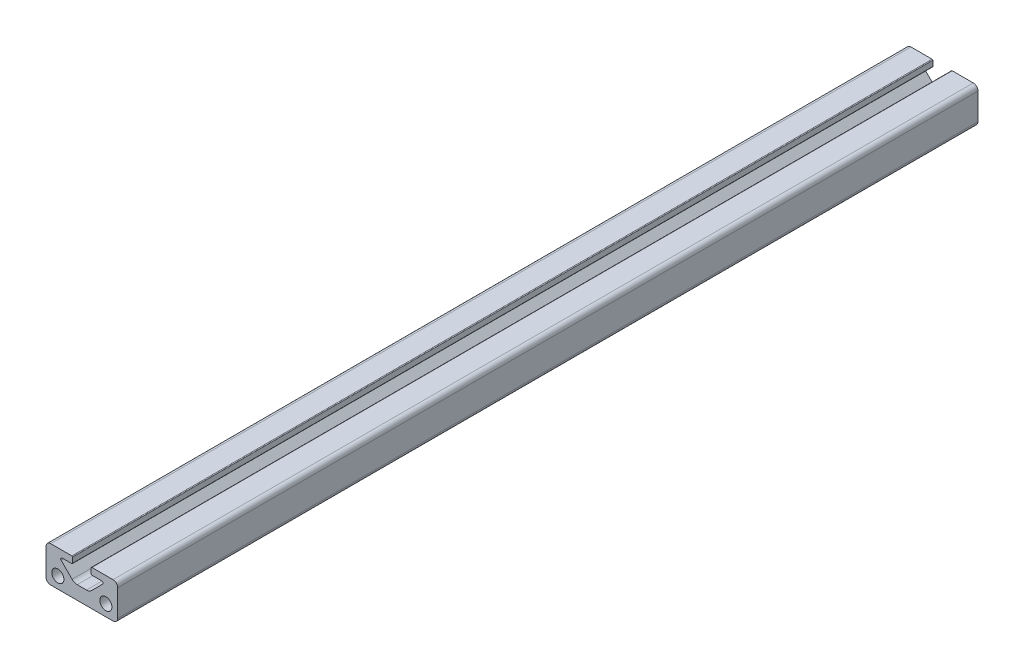
ISO-10303-21;
HEADER;
FILE_DESCRIPTION(('STEP AP214'),'2;1');
FILE_NAME('part.step','',(''),(''),'','','');
FILE_SCHEMA(('AUTOMOTIVE_DESIGN { 1 0 10303 214 1 1 1 1 }'));
ENDSEC;
DATA;
#1=APPLICATION_CONTEXT('core data for automotive mechanical design processes');
#2=APPLICATION_PROTOCOL_DEFINITION('international standard','automotive_design',2000,#1);
#3=PRODUCT_CONTEXT('',#1,'mechanical');
#4=PRODUCT('Part','Part','',(#3));
#5=PRODUCT_RELATED_PRODUCT_CATEGORY('part','',(#4));
#6=PRODUCT_DEFINITION_FORMATION('','',#4);
#7=PRODUCT_DEFINITION_CONTEXT('part definition',#1,'design');
#8=PRODUCT_DEFINITION('design','',#6,#7);
#9=PRODUCT_DEFINITION_SHAPE('','',#8);
#10=(LENGTH_UNIT() NAMED_UNIT(*) SI_UNIT(.MILLI.,.METRE.));
#11=(NAMED_UNIT(*) PLANE_ANGLE_UNIT() SI_UNIT($,.RADIAN.));
#12=(NAMED_UNIT(*) SI_UNIT($,.STERADIAN.) SOLID_ANGLE_UNIT());
#13=UNCERTAINTY_MEASURE_WITH_UNIT(LENGTH_MEASURE(1.E-05),#10,'distance_accuracy_value','');
#14=(GEOMETRIC_REPRESENTATION_CONTEXT(3) GLOBAL_UNCERTAINTY_ASSIGNED_CONTEXT((#13)) GLOBAL_UNIT_ASSIGNED_CONTEXT((#10,
#11,#12)) REPRESENTATION_CONTEXT('',''));
#15=CARTESIAN_POINT('',(0.,0.,0.));
#16=DIRECTION('',(0.,0.,1.));
#17=DIRECTION('',(1.,0.,0.));
#18=AXIS2_PLACEMENT_3D('',#15,#16,#17);
#19=CARTESIAN_POINT('',(-11.049,11.049,152.4));
#20=DIRECTION('',(0.,0.,1.));
#21=DIRECTION('',(1.,0.,0.));
#22=AXIS2_PLACEMENT_3D('',#19,#20,#21);
#23=PLANE('',#22);
#24=CARTESIAN_POINT('',(8.509,4.064,152.4));
#25=DIRECTION('',(0.,0.,1.));
#26=DIRECTION('',(1.,0.,0.));
#27=AXIS2_PLACEMENT_3D('',#24,#25,#26);
#28=CIRCLE('',#27,2.1463);
#29=CARTESIAN_POINT('',(10.6553,4.064,152.4));
#30=VERTEX_POINT('',#29);
#31=EDGE_CURVE('E513',#30,#30,#28,.T.);
#32=ORIENTED_EDGE('',*,*,#31,.F.);
#33=EDGE_LOOP('',(#32));
#34=FACE_BOUND('',#33,.T.);
#35=DIRECTION('',(0.,-1.,0.));
#36=VECTOR('',#35,1.);
#37=CARTESIAN_POINT('',(3.302,12.7,152.4));
#38=LINE('',#37,#36);
#39=CARTESIAN_POINT('',(3.302,12.446,152.4));
#40=VERTEX_POINT('',#39);
#41=CARTESIAN_POINT('',(3.302,10.582863886556,152.4));
#42=VERTEX_POINT('',#41);
#43=EDGE_CURVE('E480',#40,#42,#38,.T.);
#44=ORIENTED_EDGE('',*,*,#43,.T.);
#45=CARTESIAN_POINT('',(3.556,10.582863886556,152.4));
#46=DIRECTION('',(0.,0.,1.));
#47=DIRECTION('',(1.,0.,0.));
#48=AXIS2_PLACEMENT_3D('',#45,#46,#47);
#49=CIRCLE('',#48,0.254);
#50=CARTESIAN_POINT('',(3.556,10.328863886556,152.4));
#51=VERTEX_POINT('',#50);
#52=EDGE_CURVE('E269',#42,#51,#49,.T.);
#53=ORIENTED_EDGE('',*,*,#52,.T.);
#54=DIRECTION('',(1.,0.,0.));
#55=VECTOR('',#54,1.);
#56=CARTESIAN_POINT('',(3.302,10.328863886556,152.4));
#57=LINE('',#56,#55);
#58=CARTESIAN_POINT('',(6.985,10.328863886556,152.4));
#59=VERTEX_POINT('',#58);
#60=EDGE_CURVE('E472',#51,#59,#57,.T.);
#61=ORIENTED_EDGE('',*,*,#60,.T.);
#62=CARTESIAN_POINT('',(6.985,9.82086388655604,152.4));
#63=DIRECTION('',(0.,0.,-1.));
#64=DIRECTION('',(1.,0.,0.));
#65=AXIS2_PLACEMENT_3D('',#62,#63,#64);
#66=CIRCLE('',#65,0.508);
#67=CARTESIAN_POINT('',(7.34421024484277,9.46165364171327,152.4));
#68=VERTEX_POINT('',#67);
#69=EDGE_CURVE('E465',#59,#68,#66,.T.);
#70=ORIENTED_EDGE('',*,*,#69,.T.);
#71=DIRECTION('',(-0.707106781186546,-0.707106781186549,0.));
#72=VECTOR('',#71,1.);
#73=CARTESIAN_POINT('',(7.34421024484277,9.46165364171327,152.4));
#74=LINE('',#73,#72);
#75=CARTESIAN_POINT('',(3.45250537891568,5.56994877578617,152.4));
#76=VERTEX_POINT('',#75);
#77=EDGE_CURVE('E460',#68,#76,#74,.T.);
#78=ORIENTED_EDGE('',*,*,#77,.T.);
#79=CARTESIAN_POINT('',(1.65645415470184,7.366,152.4));
#80=DIRECTION('',(0.,0.,-1.));
#81=DIRECTION('',(1.,0.,0.));
#82=AXIS2_PLACEMENT_3D('',#79,#80,#81);
#83=CIRCLE('',#82,2.54);
#84=CARTESIAN_POINT('',(1.65645415470184,4.826,152.4));
#85=VERTEX_POINT('',#84);
#86=EDGE_CURVE('E456',#76,#85,#83,.T.);
#87=ORIENTED_EDGE('',*,*,#86,.T.);
#88=DIRECTION('',(-1.,0.,0.));
#89=VECTOR('',#88,1.);
#90=CARTESIAN_POINT('',(1.65645415470184,4.826,152.4));
#91=LINE('',#90,#89);
#92=CARTESIAN_POINT('',(-1.65645415470184,4.826,152.4));
#93=VERTEX_POINT('',#92);
#94=EDGE_CURVE('E447',#85,#93,#91,.T.);
#95=ORIENTED_EDGE('',*,*,#94,.T.);
#96=CARTESIAN_POINT('',(-1.65645415470184,7.366,152.4));
#97=DIRECTION('',(0.,0.,-1.));
#98=DIRECTION('',(1.,0.,0.));
#99=AXIS2_PLACEMENT_3D('',#96,#97,#98);
#100=CIRCLE('',#99,2.54);
#101=CARTESIAN_POINT('',(-3.45250537891568,5.56994877578617,152.4));
#102=VERTEX_POINT('',#101);
#103=EDGE_CURVE('E442',#93,#102,#100,.T.);
#104=ORIENTED_EDGE('',*,*,#103,.T.);
#105=DIRECTION('',(-0.707106781186546,0.707106781186549,0.));
#106=VECTOR('',#105,1.);
#107=CARTESIAN_POINT('',(-3.45250537891568,5.56994877578617,152.4));
#108=LINE('',#107,#106);
#109=CARTESIAN_POINT('',(-7.34421024484277,9.46165364171327,152.4));
#110=VERTEX_POINT('',#109);
#111=EDGE_CURVE('E438',#102,#110,#108,.T.);
#112=ORIENTED_EDGE('',*,*,#111,.T.);
#113=CARTESIAN_POINT('',(-6.985,9.82086388655604,152.4));
#114=DIRECTION('',(0.,0.,-1.));
#115=DIRECTION('',(1.,0.,0.));
#116=AXIS2_PLACEMENT_3D('',#113,#114,#115);
#117=CIRCLE('',#116,0.507999999999999);
#118=CARTESIAN_POINT('',(-6.985,10.328863886556,152.4));
#119=VERTEX_POINT('',#118);
#120=EDGE_CURVE('E294',#110,#119,#117,.T.);
#121=ORIENTED_EDGE('',*,*,#120,.T.);
#122=DIRECTION('',(1.,0.,0.));
#123=VECTOR('',#122,1.);
#124=CARTESIAN_POINT('',(-6.985,10.328863886556,152.4));
#125=LINE('',#124,#123);
#126=CARTESIAN_POINT('',(-3.556,10.328863886556,152.4));
#127=VERTEX_POINT('',#126);
#128=EDGE_CURVE('E288',#119,#127,#125,.T.);
#129=ORIENTED_EDGE('',*,*,#128,.T.);
#130=CARTESIAN_POINT('',(-3.556,10.582863886556,152.4));
#131=DIRECTION('',(0.,0.,1.));
#132=DIRECTION('',(1.,0.,0.));
#133=AXIS2_PLACEMENT_3D('',#130,#131,#132);
#134=CIRCLE('',#133,0.254);
#135=CARTESIAN_POINT('',(-3.302,10.582863886556,152.4));
#136=VERTEX_POINT('',#135);
#137=EDGE_CURVE('E263',#127,#136,#134,.T.);
#138=ORIENTED_EDGE('',*,*,#137,.T.);
#139=DIRECTION('',(0.,1.,0.));
#140=VECTOR('',#139,1.);
#141=CARTESIAN_POINT('',(-3.302,12.7,152.4));
#142=LINE('',#141,#140);
#143=CARTESIAN_POINT('',(-3.302,12.446,152.4));
#144=VERTEX_POINT('',#143);
#145=EDGE_CURVE('E297',#136,#144,#142,.T.);
#146=ORIENTED_EDGE('',*,*,#145,.T.);
#147=CARTESIAN_POINT('',(-3.556,12.446,152.4));
#148=DIRECTION('',(0.,0.,1.));
#149=DIRECTION('',(1.,0.,0.));
#150=AXIS2_PLACEMENT_3D('',#147,#148,#149);
#151=CIRCLE('',#150,0.254);
#152=CARTESIAN_POINT('',(-3.556,12.7,152.4));
#153=VERTEX_POINT('',#152);
#154=EDGE_CURVE('E57',#144,#153,#151,.T.);
#155=ORIENTED_EDGE('',*,*,#154,.T.);
#156=DIRECTION('',(-1.,0.,0.));
#157=VECTOR('',#156,1.);
#158=CARTESIAN_POINT('',(-11.049,12.7,152.4));
#159=LINE('',#158,#157);
#160=CARTESIAN_POINT('',(-11.049,12.7,152.4));
#161=VERTEX_POINT('',#160);
#162=EDGE_CURVE('E221',#153,#161,#159,.T.);
#163=ORIENTED_EDGE('',*,*,#162,.T.);
#164=CARTESIAN_POINT('',(-11.049,11.049,152.4));
#165=DIRECTION('',(0.,0.,1.));
#166=DIRECTION('',(1.,0.,0.));
#167=AXIS2_PLACEMENT_3D('',#164,#165,#166);
#168=CIRCLE('',#167,1.651);
#169=CARTESIAN_POINT('',(-12.7,11.049,152.4));
#170=VERTEX_POINT('',#169);
#171=EDGE_CURVE('E216',#161,#170,#168,.T.);
#172=ORIENTED_EDGE('',*,*,#171,.T.);
#173=DIRECTION('',(0.,-1.,0.));
#174=VECTOR('',#173,1.);
#175=CARTESIAN_POINT('',(-12.7,11.049,152.4));
#176=LINE('',#175,#174);
#177=CARTESIAN_POINT('',(-12.7,1.65099999999999,152.4));
#178=VERTEX_POINT('',#177);
#179=EDGE_CURVE('E205',#170,#178,#176,.T.);
#180=ORIENTED_EDGE('',*,*,#179,.T.);
#181=CARTESIAN_POINT('',(-11.049,1.65099999999999,152.4));
#182=DIRECTION('',(0.,0.,1.));
#183=DIRECTION('',(1.,0.,0.));
#184=AXIS2_PLACEMENT_3D('',#181,#182,#183);
#185=CIRCLE('',#184,1.651);
#186=CARTESIAN_POINT('',(-11.049,0.,152.4));
#187=VERTEX_POINT('',#186);
#188=EDGE_CURVE('E215',#178,#187,#185,.T.);
#189=ORIENTED_EDGE('',*,*,#188,.T.);
#190=DIRECTION('',(1.,0.,0.));
#191=VECTOR('',#190,1.);
#192=CARTESIAN_POINT('',(11.049,0.,152.4));
#193=LINE('',#192,#191);
#194=CARTESIAN_POINT('',(11.049,0.,152.4));
#195=VERTEX_POINT('',#194);
#196=EDGE_CURVE('E376',#187,#195,#193,.T.);
#197=ORIENTED_EDGE('',*,*,#196,.T.);
#198=CARTESIAN_POINT('',(11.049,1.651,152.4));
#199=DIRECTION('',(0.,0.,1.));
#200=DIRECTION('',(1.,0.,0.));
#201=AXIS2_PLACEMENT_3D('',#198,#199,#200);
#202=CIRCLE('',#201,1.651);
#203=CARTESIAN_POINT('',(12.7,1.651,152.4));
#204=VERTEX_POINT('',#203);
#205=EDGE_CURVE('E519',#195,#204,#202,.T.);
#206=ORIENTED_EDGE('',*,*,#205,.T.);
#207=DIRECTION('',(0.,1.,0.));
#208=VECTOR('',#207,1.);
#209=CARTESIAN_POINT('',(12.7,1.651,152.4));
#210=LINE('',#209,#208);
#211=CARTESIAN_POINT('',(12.7,11.049,152.4));
#212=VERTEX_POINT('',#211);
#213=EDGE_CURVE('E524',#204,#212,#210,.T.);
#214=ORIENTED_EDGE('',*,*,#213,.T.);
#215=CARTESIAN_POINT('',(11.049,11.049,152.4));
#216=DIRECTION('',(0.,0.,1.));
#217=DIRECTION('',(1.,0.,0.));
#218=AXIS2_PLACEMENT_3D('',#215,#216,#217);
#219=CIRCLE('',#218,1.651);
#220=CARTESIAN_POINT('',(11.049,12.7,152.4));
#221=VERTEX_POINT('',#220);
#222=EDGE_CURVE('E490',#212,#221,#219,.T.);
#223=ORIENTED_EDGE('',*,*,#222,.T.);
#224=DIRECTION('',(-1.,0.,0.));
#225=VECTOR('',#224,1.);
#226=CARTESIAN_POINT('',(3.302,12.7,152.4));
#227=LINE('',#226,#225);
#228=CARTESIAN_POINT('',(3.556,12.7,152.4));
#229=VERTEX_POINT('',#228);
#230=EDGE_CURVE('E485',#221,#229,#227,.T.);
#231=ORIENTED_EDGE('',*,*,#230,.T.);
#232=CARTESIAN_POINT('',(3.556,12.446,152.4));
#233=DIRECTION('',(0.,0.,1.));
#234=DIRECTION('',(1.,0.,0.));
#235=AXIS2_PLACEMENT_3D('',#232,#233,#234);
#236=CIRCLE('',#235,0.254);
#237=EDGE_CURVE('E266',#229,#40,#236,.T.);
#238=ORIENTED_EDGE('',*,*,#237,.T.);
#239=EDGE_LOOP('',(#44,#53,#61,#70,#78,#87,#95,#104,#112,#121,#129,#138,#146,#155,#163,#172,
#180,#189,#197,#206,#214,#223,#231,#238));
#240=FACE_BOUND('',#239,.T.);
#241=CARTESIAN_POINT('',(-8.509,4.064,152.4));
#242=DIRECTION('',(0.,0.,1.));
#243=DIRECTION('',(1.,0.,0.));
#244=AXIS2_PLACEMENT_3D('',#241,#242,#243);
#245=CIRCLE('',#244,2.1463);
#246=CARTESIAN_POINT('',(-6.3627,4.064,152.4));
#247=VERTEX_POINT('',#246);
#248=EDGE_CURVE('E782',#247,#247,#245,.T.);
#249=ORIENTED_EDGE('',*,*,#248,.F.);
#250=EDGE_LOOP('',(#249));
#251=FACE_BOUND('',#250,.T.);
#252=ADVANCED_FACE('F41',(#34,#240,#251),#23,.T.);
#253=CARTESIAN_POINT('',(-11.049,11.049,-152.4));
#254=DIRECTION('',(0.,0.,1.));
#255=DIRECTION('',(1.,0.,0.));
#256=AXIS2_PLACEMENT_3D('',#253,#254,#255);
#257=PLANE('',#256);
#258=DIRECTION('',(1.,0.,0.));
#259=VECTOR('',#258,1.);
#260=CARTESIAN_POINT('',(3.302,10.328863886556,-152.4));
#261=LINE('',#260,#259);
#262=CARTESIAN_POINT('',(3.556,10.328863886556,-152.4));
#263=VERTEX_POINT('',#262);
#264=CARTESIAN_POINT('',(6.985,10.328863886556,-152.4));
#265=VERTEX_POINT('',#264);
#266=EDGE_CURVE('E406',#263,#265,#261,.T.);
#267=ORIENTED_EDGE('',*,*,#266,.F.);
#268=CARTESIAN_POINT('',(3.556,10.582863886556,-152.4));
#269=DIRECTION('',(0.,0.,1.));
#270=DIRECTION('',(1.,0.,0.));
#271=AXIS2_PLACEMENT_3D('',#268,#269,#270);
#272=CIRCLE('',#271,0.254);
#273=CARTESIAN_POINT('',(3.302,10.582863886556,-152.4));
#274=VERTEX_POINT('',#273);
#275=EDGE_CURVE('E251',#263,#274,#272,.F.);
#276=ORIENTED_EDGE('',*,*,#275,.T.);
#277=DIRECTION('',(0.,-1.,0.));
#278=VECTOR('',#277,1.);
#279=CARTESIAN_POINT('',(3.302,12.7,-152.4));
#280=LINE('',#279,#278);
#281=CARTESIAN_POINT('',(3.302,12.446,-152.4));
#282=VERTEX_POINT('',#281);
#283=EDGE_CURVE('E402',#282,#274,#280,.T.);
#284=ORIENTED_EDGE('',*,*,#283,.F.);
#285=CARTESIAN_POINT('',(3.556,12.446,-152.4));
#286=DIRECTION('',(0.,0.,1.));
#287=DIRECTION('',(1.,0.,0.));
#288=AXIS2_PLACEMENT_3D('',#285,#286,#287);
#289=CIRCLE('',#288,0.254);
#290=CARTESIAN_POINT('',(3.556,12.7,-152.4));
#291=VERTEX_POINT('',#290);
#292=EDGE_CURVE('E248',#282,#291,#289,.F.);
#293=ORIENTED_EDGE('',*,*,#292,.T.);
#294=DIRECTION('',(-1.,0.,0.));
#295=VECTOR('',#294,1.);
#296=CARTESIAN_POINT('',(3.302,12.7,-152.4));
#297=LINE('',#296,#295);
#298=CARTESIAN_POINT('',(11.049,12.7,-152.4));
#299=VERTEX_POINT('',#298);
#300=EDGE_CURVE('E398',#299,#291,#297,.T.);
#301=ORIENTED_EDGE('',*,*,#300,.F.);
#302=CARTESIAN_POINT('',(11.049,11.049,-152.4));
#303=DIRECTION('',(0.,0.,1.));
#304=DIRECTION('',(1.,0.,0.));
#305=AXIS2_PLACEMENT_3D('',#302,#303,#304);
#306=CIRCLE('',#305,1.651);
#307=CARTESIAN_POINT('',(12.7,11.049,-152.4));
#308=VERTEX_POINT('',#307);
#309=EDGE_CURVE('E395',#308,#299,#306,.T.);
#310=ORIENTED_EDGE('',*,*,#309,.F.);
#311=DIRECTION('',(0.,1.,0.));
#312=VECTOR('',#311,1.);
#313=CARTESIAN_POINT('',(12.7,1.651,-152.4));
#314=LINE('',#313,#312);
#315=CARTESIAN_POINT('',(12.7,1.651,-152.4));
#316=VERTEX_POINT('',#315);
#317=EDGE_CURVE('E387',#316,#308,#314,.T.);
#318=ORIENTED_EDGE('',*,*,#317,.F.);
#319=CARTESIAN_POINT('',(11.049,1.651,-152.4));
#320=DIRECTION('',(0.,0.,1.));
#321=DIRECTION('',(1.,0.,0.));
#322=AXIS2_PLACEMENT_3D('',#319,#320,#321);
#323=CIRCLE('',#322,1.651);
#324=CARTESIAN_POINT('',(11.049,0.,-152.4));
#325=VERTEX_POINT('',#324);
#326=EDGE_CURVE('E382',#325,#316,#323,.T.);
#327=ORIENTED_EDGE('',*,*,#326,.F.);
#328=DIRECTION('',(1.,0.,0.));
#329=VECTOR('',#328,1.);
#330=CARTESIAN_POINT('',(11.049,0.,-152.4));
#331=LINE('',#330,#329);
#332=CARTESIAN_POINT('',(-11.049,0.,-152.4));
#333=VERTEX_POINT('',#332);
#334=EDGE_CURVE('E375',#333,#325,#331,.T.);
#335=ORIENTED_EDGE('',*,*,#334,.F.);
#336=CARTESIAN_POINT('',(-11.049,1.65099999999999,-152.4));
#337=DIRECTION('',(0.,0.,1.));
#338=DIRECTION('',(1.,0.,0.));
#339=AXIS2_PLACEMENT_3D('',#336,#337,#338);
#340=CIRCLE('',#339,1.651);
#341=CARTESIAN_POINT('',(-12.7,1.65099999999999,-152.4));
#342=VERTEX_POINT('',#341);
#343=EDGE_CURVE('E380',#342,#333,#340,.T.);
#344=ORIENTED_EDGE('',*,*,#343,.F.);
#345=DIRECTION('',(0.,-1.,0.));
#346=VECTOR('',#345,1.);
#347=CARTESIAN_POINT('',(-12.7,11.049,-152.4));
#348=LINE('',#347,#346);
#349=CARTESIAN_POINT('',(-12.7,11.049,-152.4));
#350=VERTEX_POINT('',#349);
#351=EDGE_CURVE('E389',#350,#342,#348,.T.);
#352=ORIENTED_EDGE('',*,*,#351,.F.);
#353=CARTESIAN_POINT('',(-11.049,11.049,-152.4));
#354=DIRECTION('',(0.,0.,1.));
#355=DIRECTION('',(1.,0.,0.));
#356=AXIS2_PLACEMENT_3D('',#353,#354,#355);
#357=CIRCLE('',#356,1.651);
#358=CARTESIAN_POINT('',(-11.049,12.7,-152.4));
#359=VERTEX_POINT('',#358);
#360=EDGE_CURVE('E230',#359,#350,#357,.T.);
#361=ORIENTED_EDGE('',*,*,#360,.F.);
#362=DIRECTION('',(-1.,0.,0.));
#363=VECTOR('',#362,1.);
#364=CARTESIAN_POINT('',(-11.049,12.7,-152.4));
#365=LINE('',#364,#363);
#366=CARTESIAN_POINT('',(-3.556,12.7,-152.4));
#367=VERTEX_POINT('',#366);
#368=EDGE_CURVE('E226',#367,#359,#365,.T.);
#369=ORIENTED_EDGE('',*,*,#368,.F.);
#370=CARTESIAN_POINT('',(-3.556,12.446,-152.4));
#371=DIRECTION('',(0.,0.,1.));
#372=DIRECTION('',(1.,0.,0.));
#373=AXIS2_PLACEMENT_3D('',#370,#371,#372);
#374=CIRCLE('',#373,0.254);
#375=CARTESIAN_POINT('',(-3.302,12.446,-152.4));
#376=VERTEX_POINT('',#375);
#377=EDGE_CURVE('E237',#367,#376,#374,.F.);
#378=ORIENTED_EDGE('',*,*,#377,.T.);
#379=DIRECTION('',(0.,1.,0.));
#380=VECTOR('',#379,1.);
#381=CARTESIAN_POINT('',(-3.302,12.7,-152.4));
#382=LINE('',#381,#380);
#383=CARTESIAN_POINT('',(-3.302,10.582863886556,-152.4));
#384=VERTEX_POINT('',#383);
#385=EDGE_CURVE('E303',#384,#376,#382,.T.);
#386=ORIENTED_EDGE('',*,*,#385,.F.);
#387=CARTESIAN_POINT('',(-3.556,10.582863886556,-152.4));
#388=DIRECTION('',(0.,0.,1.));
#389=DIRECTION('',(1.,0.,0.));
#390=AXIS2_PLACEMENT_3D('',#387,#388,#389);
#391=CIRCLE('',#390,0.254);
#392=CARTESIAN_POINT('',(-3.556,10.328863886556,-152.4));
#393=VERTEX_POINT('',#392);
#394=EDGE_CURVE('E245',#384,#393,#391,.F.);
#395=ORIENTED_EDGE('',*,*,#394,.T.);
#396=DIRECTION('',(1.,0.,0.));
#397=VECTOR('',#396,1.);
#398=CARTESIAN_POINT('',(-6.985,10.328863886556,-152.4));
#399=LINE('',#398,#397);
#400=CARTESIAN_POINT('',(-6.985,10.328863886556,-152.4));
#401=VERTEX_POINT('',#400);
#402=EDGE_CURVE('E290',#401,#393,#399,.T.);
#403=ORIENTED_EDGE('',*,*,#402,.F.);
#404=CARTESIAN_POINT('',(-6.985,9.82086388655604,-152.4));
#405=DIRECTION('',(0.,0.,-1.));
#406=DIRECTION('',(1.,0.,0.));
#407=AXIS2_PLACEMENT_3D('',#404,#405,#406);
#408=CIRCLE('',#407,0.507999999999999);
#409=CARTESIAN_POINT('',(-7.34421024484277,9.46165364171327,-152.4));
#410=VERTEX_POINT('',#409);
#411=EDGE_CURVE('E314',#410,#401,#408,.T.);
#412=ORIENTED_EDGE('',*,*,#411,.F.);
#413=DIRECTION('',(-0.707106781186546,0.707106781186549,0.));
#414=VECTOR('',#413,1.);
#415=CARTESIAN_POINT('',(-3.45250537891568,5.56994877578617,-152.4));
#416=LINE('',#415,#414);
#417=CARTESIAN_POINT('',(-3.45250537891568,5.56994877578617,-152.4));
#418=VERTEX_POINT('',#417);
#419=EDGE_CURVE('E424',#418,#410,#416,.T.);
#420=ORIENTED_EDGE('',*,*,#419,.F.);
#421=CARTESIAN_POINT('',(-1.65645415470184,7.366,-152.4));
#422=DIRECTION('',(0.,0.,-1.));
#423=DIRECTION('',(1.,0.,0.));
#424=AXIS2_PLACEMENT_3D('',#421,#422,#423);
#425=CIRCLE('',#424,2.54);
#426=CARTESIAN_POINT('',(-1.65645415470184,4.826,-152.4));
#427=VERTEX_POINT('',#426);
#428=EDGE_CURVE('E421',#427,#418,#425,.T.);
#429=ORIENTED_EDGE('',*,*,#428,.F.);
#430=DIRECTION('',(-1.,0.,0.));
#431=VECTOR('',#430,1.);
#432=CARTESIAN_POINT('',(1.65645415470184,4.826,-152.4));
#433=LINE('',#432,#431);
#434=CARTESIAN_POINT('',(1.65645415470184,4.826,-152.4));
#435=VERTEX_POINT('',#434);
#436=EDGE_CURVE('E418',#435,#427,#433,.T.);
#437=ORIENTED_EDGE('',*,*,#436,.F.);
#438=CARTESIAN_POINT('',(1.65645415470184,7.366,-152.4));
#439=DIRECTION('',(0.,0.,-1.));
#440=DIRECTION('',(1.,0.,0.));
#441=AXIS2_PLACEMENT_3D('',#438,#439,#440);
#442=CIRCLE('',#441,2.54);
#443=CARTESIAN_POINT('',(3.45250537891568,5.56994877578617,-152.4));
#444=VERTEX_POINT('',#443);
#445=EDGE_CURVE('E415',#444,#435,#442,.T.);
#446=ORIENTED_EDGE('',*,*,#445,.F.);
#447=DIRECTION('',(-0.707106781186546,-0.707106781186549,0.));
#448=VECTOR('',#447,1.);
#449=CARTESIAN_POINT('',(7.34421024484277,9.46165364171327,-152.4));
#450=LINE('',#449,#448);
#451=CARTESIAN_POINT('',(7.34421024484277,9.46165364171327,-152.4));
#452=VERTEX_POINT('',#451);
#453=EDGE_CURVE('E412',#452,#444,#450,.T.);
#454=ORIENTED_EDGE('',*,*,#453,.F.);
#455=CARTESIAN_POINT('',(6.985,9.82086388655604,-152.4));
#456=DIRECTION('',(0.,0.,-1.));
#457=DIRECTION('',(1.,0.,0.));
#458=AXIS2_PLACEMENT_3D('',#455,#456,#457);
#459=CIRCLE('',#458,0.508);
#460=EDGE_CURVE('E409',#265,#452,#459,.T.);
#461=ORIENTED_EDGE('',*,*,#460,.F.);
#462=EDGE_LOOP('',(#267,#276,#284,#293,#301,#310,#318,#327,#335,#344,#352,#361,#369,#378,#386,
#395,#403,#412,#420,#429,#437,#446,#454,#461));
#463=FACE_BOUND('',#462,.T.);
#464=CARTESIAN_POINT('',(8.509,4.064,-152.4));
#465=DIRECTION('',(0.,0.,1.));
#466=DIRECTION('',(1.,0.,0.));
#467=AXIS2_PLACEMENT_3D('',#464,#465,#466);
#468=CIRCLE('',#467,2.1463);
#469=CARTESIAN_POINT('',(10.6553,4.064,-152.4));
#470=VERTEX_POINT('',#469);
#471=EDGE_CURVE('E790',#470,#470,#468,.T.);
#472=ORIENTED_EDGE('',*,*,#471,.T.);
#473=EDGE_LOOP('',(#472));
#474=FACE_BOUND('',#473,.T.);
#475=CARTESIAN_POINT('',(-8.509,4.064,-152.4));
#476=DIRECTION('',(0.,0.,1.));
#477=DIRECTION('',(1.,0.,0.));
#478=AXIS2_PLACEMENT_3D('',#475,#476,#477);
#479=CIRCLE('',#478,2.1463);
#480=CARTESIAN_POINT('',(-6.3627,4.064,-152.4));
#481=VERTEX_POINT('',#480);
#482=EDGE_CURVE('E785',#481,#481,#479,.T.);
#483=ORIENTED_EDGE('',*,*,#482,.T.);
#484=EDGE_LOOP('',(#483));
#485=FACE_BOUND('',#484,.T.);
#486=ADVANCED_FACE('F306',(#463,#474,#485),#257,.F.);
#487=CARTESIAN_POINT('',(-11.049,11.049,152.4));
#488=DIRECTION('',(0.,0.,-1.));
#489=DIRECTION('',(-1.,0.,0.));
#490=AXIS2_PLACEMENT_3D('',#487,#488,#489);
#491=CYLINDRICAL_SURFACE('',#490,1.651);
#492=ORIENTED_EDGE('',*,*,#360,.T.);
#493=DIRECTION('',(0.,0.,-1.));
#494=VECTOR('',#493,1.);
#495=CARTESIAN_POINT('',(-12.7,11.049,152.4));
#496=LINE('',#495,#494);
#497=EDGE_CURVE('E209',#170,#350,#496,.T.);
#498=ORIENTED_EDGE('',*,*,#497,.F.);
#499=ORIENTED_EDGE('',*,*,#171,.F.);
#500=DIRECTION('',(0.,0.,-1.));
#501=VECTOR('',#500,1.);
#502=CARTESIAN_POINT('',(-11.049,12.7,152.4));
#503=LINE('',#502,#501);
#504=EDGE_CURVE('E318',#161,#359,#503,.T.);
#505=ORIENTED_EDGE('',*,*,#504,.T.);
#506=EDGE_LOOP('',(#492,#498,#499,#505));
#507=FACE_BOUND('',#506,.T.);
#508=ADVANCED_FACE('F228',(#507),#491,.T.);
#509=CARTESIAN_POINT('',(-12.7,11.049,152.4));
#510=DIRECTION('',(1.,0.,0.));
#511=DIRECTION('',(0.,0.,-1.));
#512=AXIS2_PLACEMENT_3D('',#509,#510,#511);
#513=PLANE('',#512);
#514=ORIENTED_EDGE('',*,*,#351,.T.);
#515=DIRECTION('',(0.,0.,-1.));
#516=VECTOR('',#515,1.);
#517=CARTESIAN_POINT('',(-12.7,1.65099999999999,152.4));
#518=LINE('',#517,#516);
#519=EDGE_CURVE('E212',#178,#342,#518,.T.);
#520=ORIENTED_EDGE('',*,*,#519,.F.);
#521=ORIENTED_EDGE('',*,*,#179,.F.);
#522=ORIENTED_EDGE('',*,*,#497,.T.);
#523=EDGE_LOOP('',(#514,#520,#521,#522));
#524=FACE_BOUND('',#523,.T.);
#525=ADVANCED_FACE('F207',(#524),#513,.F.);
#526=CARTESIAN_POINT('',(-11.049,1.65099999999999,152.4));
#527=DIRECTION('',(0.,0.,-1.));
#528=DIRECTION('',(-1.,0.,0.));
#529=AXIS2_PLACEMENT_3D('',#526,#527,#528);
#530=CYLINDRICAL_SURFACE('',#529,1.651);
#531=ORIENTED_EDGE('',*,*,#343,.T.);
#532=DIRECTION('',(0.,0.,-1.));
#533=VECTOR('',#532,1.);
#534=CARTESIAN_POINT('',(-11.049,0.,152.4));
#535=LINE('',#534,#533);
#536=EDGE_CURVE('E239',#187,#333,#535,.T.);
#537=ORIENTED_EDGE('',*,*,#536,.F.);
#538=ORIENTED_EDGE('',*,*,#188,.F.);
#539=ORIENTED_EDGE('',*,*,#519,.T.);
#540=EDGE_LOOP('',(#531,#537,#538,#539));
#541=FACE_BOUND('',#540,.T.);
#542=ADVANCED_FACE('F515',(#541),#530,.T.);
#543=CARTESIAN_POINT('',(11.049,0.,152.4));
#544=DIRECTION('',(0.,1.,0.));
#545=DIRECTION('',(-1.,0.,0.));
#546=AXIS2_PLACEMENT_3D('',#543,#544,#545);
#547=PLANE('',#546);
#548=ORIENTED_EDGE('',*,*,#334,.T.);
#549=DIRECTION('',(0.,0.,-1.));
#550=VECTOR('',#549,1.);
#551=CARTESIAN_POINT('',(11.049,0.,152.4));
#552=LINE('',#551,#550);
#553=EDGE_CURVE('E364',#195,#325,#552,.T.);
#554=ORIENTED_EDGE('',*,*,#553,.F.);
#555=ORIENTED_EDGE('',*,*,#196,.F.);
#556=ORIENTED_EDGE('',*,*,#536,.T.);
#557=EDGE_LOOP('',(#548,#554,#555,#556));
#558=FACE_BOUND('',#557,.T.);
#559=ADVANCED_FACE('F373',(#558),#547,.F.);
#560=CARTESIAN_POINT('',(11.049,1.651,152.4));
#561=DIRECTION('',(0.,0.,-1.));
#562=DIRECTION('',(-1.,0.,0.));
#563=AXIS2_PLACEMENT_3D('',#560,#561,#562);
#564=CYLINDRICAL_SURFACE('',#563,1.651);
#565=ORIENTED_EDGE('',*,*,#326,.T.);
#566=DIRECTION('',(0.,0.,-1.));
#567=VECTOR('',#566,1.);
#568=CARTESIAN_POINT('',(12.7,1.651,152.4));
#569=LINE('',#568,#567);
#570=EDGE_CURVE('E360',#204,#316,#569,.T.);
#571=ORIENTED_EDGE('',*,*,#570,.F.);
#572=ORIENTED_EDGE('',*,*,#205,.F.);
#573=ORIENTED_EDGE('',*,*,#553,.T.);
#574=EDGE_LOOP('',(#565,#571,#572,#573));
#575=FACE_BOUND('',#574,.T.);
#576=ADVANCED_FACE('F546',(#575),#564,.T.);
#577=CARTESIAN_POINT('',(12.7,1.651,152.4));
#578=DIRECTION('',(-1.,0.,0.));
#579=DIRECTION('',(0.,0.,1.));
#580=AXIS2_PLACEMENT_3D('',#577,#578,#579);
#581=PLANE('',#580);
#582=ORIENTED_EDGE('',*,*,#317,.T.);
#583=DIRECTION('',(0.,0.,-1.));
#584=VECTOR('',#583,1.);
#585=CARTESIAN_POINT('',(12.7,11.049,152.4));
#586=LINE('',#585,#584);
#587=EDGE_CURVE('E356',#212,#308,#586,.T.);
#588=ORIENTED_EDGE('',*,*,#587,.F.);
#589=ORIENTED_EDGE('',*,*,#213,.F.);
#590=ORIENTED_EDGE('',*,*,#570,.T.);
#591=EDGE_LOOP('',(#582,#588,#589,#590));
#592=FACE_BOUND('',#591,.T.);
#593=ADVANCED_FACE('F542',(#592),#581,.F.);
#594=CARTESIAN_POINT('',(11.049,11.049,152.4));
#595=DIRECTION('',(0.,0.,-1.));
#596=DIRECTION('',(-1.,0.,0.));
#597=AXIS2_PLACEMENT_3D('',#594,#595,#596);
#598=CYLINDRICAL_SURFACE('',#597,1.651);
#599=ORIENTED_EDGE('',*,*,#309,.T.);
#600=DIRECTION('',(0.,0.,-1.));
#601=VECTOR('',#600,1.);
#602=CARTESIAN_POINT('',(11.049,12.7,152.4));
#603=LINE('',#602,#601);
#604=EDGE_CURVE('E352',#221,#299,#603,.T.);
#605=ORIENTED_EDGE('',*,*,#604,.F.);
#606=ORIENTED_EDGE('',*,*,#222,.F.);
#607=ORIENTED_EDGE('',*,*,#587,.T.);
#608=EDGE_LOOP('',(#599,#605,#606,#607));
#609=FACE_BOUND('',#608,.T.);
#610=ADVANCED_FACE('F533',(#609),#598,.T.);
#611=CARTESIAN_POINT('',(3.302,12.7,152.4));
#612=DIRECTION('',(0.,-1.,0.));
#613=DIRECTION('',(1.,0.,0.));
#614=AXIS2_PLACEMENT_3D('',#611,#612,#613);
#615=PLANE('',#614);
#616=ORIENTED_EDGE('',*,*,#300,.T.);
#617=DIRECTION('',(0.,0.,-1.));
#618=VECTOR('',#617,1.);
#619=CARTESIAN_POINT('',(3.556,12.7,152.4));
#620=LINE('',#619,#618);
#621=EDGE_CURVE('E272',#291,#229,#620,.F.);
#622=ORIENTED_EDGE('',*,*,#621,.T.);
#623=ORIENTED_EDGE('',*,*,#230,.F.);
#624=ORIENTED_EDGE('',*,*,#604,.T.);
#625=EDGE_LOOP('',(#616,#622,#623,#624));
#626=FACE_BOUND('',#625,.T.);
#627=ADVANCED_FACE('F537',(#626),#615,.F.);
#628=CARTESIAN_POINT('',(3.302,12.7,152.4));
#629=DIRECTION('',(1.,0.,0.));
#630=DIRECTION('',(0.,1.,0.));
#631=AXIS2_PLACEMENT_3D('',#628,#629,#630);
#632=PLANE('',#631);
#633=ORIENTED_EDGE('',*,*,#283,.T.);
#634=DIRECTION('',(0.,0.,-1.));
#635=VECTOR('',#634,1.);
#636=CARTESIAN_POINT('',(3.302,10.582863886556,152.4));
#637=LINE('',#636,#635);
#638=EDGE_CURVE('E258',#274,#42,#637,.F.);
#639=ORIENTED_EDGE('',*,*,#638,.T.);
#640=ORIENTED_EDGE('',*,*,#43,.F.);
#641=DIRECTION('',(0.,0.,-1.));
#642=VECTOR('',#641,1.);
#643=CARTESIAN_POINT('',(3.302,12.446,152.4));
#644=LINE('',#643,#642);
#645=EDGE_CURVE('E254',#40,#282,#644,.T.);
#646=ORIENTED_EDGE('',*,*,#645,.T.);
#647=EDGE_LOOP('',(#633,#639,#640,#646));
#648=FACE_BOUND('',#647,.T.);
#649=ADVANCED_FACE('F479',(#648),#632,.F.);
#650=CARTESIAN_POINT('',(3.302,10.328863886556,152.4));
#651=DIRECTION('',(0.,1.,0.));
#652=DIRECTION('',(0.,0.,1.));
#653=AXIS2_PLACEMENT_3D('',#650,#651,#652);
#654=PLANE('',#653);
#655=ORIENTED_EDGE('',*,*,#60,.F.);
#656=DIRECTION('',(0.,0.,-1.));
#657=VECTOR('',#656,1.);
#658=CARTESIAN_POINT('',(3.556,10.328863886556,152.4));
#659=LINE('',#658,#657);
#660=EDGE_CURVE('E232',#51,#263,#659,.T.);
#661=ORIENTED_EDGE('',*,*,#660,.T.);
#662=ORIENTED_EDGE('',*,*,#266,.T.);
#663=DIRECTION('',(0.,0.,-1.));
#664=VECTOR('',#663,1.);
#665=CARTESIAN_POINT('',(6.985,10.328863886556,152.4));
#666=LINE('',#665,#664);
#667=EDGE_CURVE('E348',#59,#265,#666,.T.);
#668=ORIENTED_EDGE('',*,*,#667,.F.);
#669=EDGE_LOOP('',(#655,#661,#662,#668));
#670=FACE_BOUND('',#669,.T.);
#671=ADVANCED_FACE('F470',(#670),#654,.F.);
#672=CARTESIAN_POINT('',(6.985,9.82086388655604,152.4));
#673=DIRECTION('',(0.,0.,-1.));
#674=DIRECTION('',(-1.,0.,0.));
#675=AXIS2_PLACEMENT_3D('',#672,#673,#674);
#676=CYLINDRICAL_SURFACE('',#675,0.508);
#677=ORIENTED_EDGE('',*,*,#460,.T.);
#678=DIRECTION('',(0.,0.,-1.));
#679=VECTOR('',#678,1.);
#680=CARTESIAN_POINT('',(7.34421024484277,9.46165364171327,152.4));
#681=LINE('',#680,#679);
#682=EDGE_CURVE('E344',#68,#452,#681,.T.);
#683=ORIENTED_EDGE('',*,*,#682,.F.);
#684=ORIENTED_EDGE('',*,*,#69,.F.);
#685=ORIENTED_EDGE('',*,*,#667,.T.);
#686=EDGE_LOOP('',(#677,#683,#684,#685));
#687=FACE_BOUND('',#686,.T.);
#688=ADVANCED_FACE('F464',(#687),#676,.F.);
#689=CARTESIAN_POINT('',(7.34421024484277,9.46165364171327,152.4));
#690=DIRECTION('',(0.707106781186549,-0.707106781186546,0.));
#691=DIRECTION('',(0.707106781186546,0.707106781186549,0.));
#692=AXIS2_PLACEMENT_3D('',#689,#690,#691);
#693=PLANE('',#692);
#694=ORIENTED_EDGE('',*,*,#453,.T.);
#695=DIRECTION('',(0.,0.,-1.));
#696=VECTOR('',#695,1.);
#697=CARTESIAN_POINT('',(3.45250537891568,5.56994877578617,152.4));
#698=LINE('',#697,#696);
#699=EDGE_CURVE('E340',#76,#444,#698,.T.);
#700=ORIENTED_EDGE('',*,*,#699,.F.);
#701=ORIENTED_EDGE('',*,*,#77,.F.);
#702=ORIENTED_EDGE('',*,*,#682,.T.);
#703=EDGE_LOOP('',(#694,#700,#701,#702));
#704=FACE_BOUND('',#703,.T.);
#705=ADVANCED_FACE('F459',(#704),#693,.F.);
#706=CARTESIAN_POINT('',(1.65645415470184,7.366,152.4));
#707=DIRECTION('',(0.,0.,-1.));
#708=DIRECTION('',(-1.,0.,0.));
#709=AXIS2_PLACEMENT_3D('',#706,#707,#708);
#710=CYLINDRICAL_SURFACE('',#709,2.54);
#711=ORIENTED_EDGE('',*,*,#445,.T.);
#712=DIRECTION('',(0.,0.,-1.));
#713=VECTOR('',#712,1.);
#714=CARTESIAN_POINT('',(1.65645415470184,4.826,152.4));
#715=LINE('',#714,#713);
#716=EDGE_CURVE('E336',#85,#435,#715,.T.);
#717=ORIENTED_EDGE('',*,*,#716,.F.);
#718=ORIENTED_EDGE('',*,*,#86,.F.);
#719=ORIENTED_EDGE('',*,*,#699,.T.);
#720=EDGE_LOOP('',(#711,#717,#718,#719));
#721=FACE_BOUND('',#720,.T.);
#722=ADVANCED_FACE('F453',(#721),#710,.F.);
#723=CARTESIAN_POINT('',(1.65645415470184,4.826,152.4));
#724=DIRECTION('',(0.,-1.,0.));
#725=DIRECTION('',(1.,0.,0.));
#726=AXIS2_PLACEMENT_3D('',#723,#724,#725);
#727=PLANE('',#726);
#728=ORIENTED_EDGE('',*,*,#436,.T.);
#729=DIRECTION('',(0.,0.,-1.));
#730=VECTOR('',#729,1.);
#731=CARTESIAN_POINT('',(-1.65645415470184,4.826,152.4));
#732=LINE('',#731,#730);
#733=EDGE_CURVE('E332',#93,#427,#732,.T.);
#734=ORIENTED_EDGE('',*,*,#733,.F.);
#735=ORIENTED_EDGE('',*,*,#94,.F.);
#736=ORIENTED_EDGE('',*,*,#716,.T.);
#737=EDGE_LOOP('',(#728,#734,#735,#736));
#738=FACE_BOUND('',#737,.T.);
#739=ADVANCED_FACE('F446',(#738),#727,.F.);
#740=CARTESIAN_POINT('',(-1.65645415470184,7.366,152.4));
#741=DIRECTION('',(0.,0.,-1.));
#742=DIRECTION('',(-1.,0.,0.));
#743=AXIS2_PLACEMENT_3D('',#740,#741,#742);
#744=CYLINDRICAL_SURFACE('',#743,2.54);
#745=ORIENTED_EDGE('',*,*,#428,.T.);
#746=DIRECTION('',(0.,0.,-1.));
#747=VECTOR('',#746,1.);
#748=CARTESIAN_POINT('',(-3.45250537891568,5.56994877578617,152.4));
#749=LINE('',#748,#747);
#750=EDGE_CURVE('E328',#102,#418,#749,.T.);
#751=ORIENTED_EDGE('',*,*,#750,.F.);
#752=ORIENTED_EDGE('',*,*,#103,.F.);
#753=ORIENTED_EDGE('',*,*,#733,.T.);
#754=EDGE_LOOP('',(#745,#751,#752,#753));
#755=FACE_BOUND('',#754,.T.);
#756=ADVANCED_FACE('F441',(#755),#744,.F.);
#757=CARTESIAN_POINT('',(-3.45250537891568,5.56994877578617,152.4));
#758=DIRECTION('',(-0.707106781186549,-0.707106781186546,0.));
#759=DIRECTION('',(0.707106781186546,-0.707106781186549,0.));
#760=AXIS2_PLACEMENT_3D('',#757,#758,#759);
#761=PLANE('',#760);
#762=ORIENTED_EDGE('',*,*,#419,.T.);
#763=DIRECTION('',(0.,0.,-1.));
#764=VECTOR('',#763,1.);
#765=CARTESIAN_POINT('',(-7.34421024484277,9.46165364171327,152.4));
#766=LINE('',#765,#764);
#767=EDGE_CURVE('E324',#110,#410,#766,.T.);
#768=ORIENTED_EDGE('',*,*,#767,.F.);
#769=ORIENTED_EDGE('',*,*,#111,.F.);
#770=ORIENTED_EDGE('',*,*,#750,.T.);
#771=EDGE_LOOP('',(#762,#768,#769,#770));
#772=FACE_BOUND('',#771,.T.);
#773=ADVANCED_FACE('F435',(#772),#761,.F.);
#774=CARTESIAN_POINT('',(-6.985,9.82086388655604,152.4));
#775=DIRECTION('',(0.,0.,-1.));
#776=DIRECTION('',(-1.,0.,0.));
#777=AXIS2_PLACEMENT_3D('',#774,#775,#776);
#778=CYLINDRICAL_SURFACE('',#777,0.507999999999999);
#779=ORIENTED_EDGE('',*,*,#411,.T.);
#780=DIRECTION('',(0.,0.,-1.));
#781=VECTOR('',#780,1.);
#782=CARTESIAN_POINT('',(-6.985,10.328863886556,152.4));
#783=LINE('',#782,#781);
#784=EDGE_CURVE('E321',#119,#401,#783,.T.);
#785=ORIENTED_EDGE('',*,*,#784,.F.);
#786=ORIENTED_EDGE('',*,*,#120,.F.);
#787=ORIENTED_EDGE('',*,*,#767,.T.);
#788=EDGE_LOOP('',(#779,#785,#786,#787));
#789=FACE_BOUND('',#788,.T.);
#790=ADVANCED_FACE('F429',(#789),#778,.F.);
#791=CARTESIAN_POINT('',(-6.985,10.328863886556,152.4));
#792=DIRECTION('',(0.,1.,0.));
#793=DIRECTION('',(-1.,0.,0.));
#794=AXIS2_PLACEMENT_3D('',#791,#792,#793);
#795=PLANE('',#794);
#796=ORIENTED_EDGE('',*,*,#402,.T.);
#797=DIRECTION('',(0.,0.,-1.));
#798=VECTOR('',#797,1.);
#799=CARTESIAN_POINT('',(-3.556,10.328863886556,152.4));
#800=LINE('',#799,#798);
#801=EDGE_CURVE('E50',#393,#127,#800,.F.);
#802=ORIENTED_EDGE('',*,*,#801,.T.);
#803=ORIENTED_EDGE('',*,*,#128,.F.);
#804=ORIENTED_EDGE('',*,*,#784,.T.);
#805=EDGE_LOOP('',(#796,#802,#803,#804));
#806=FACE_BOUND('',#805,.T.);
#807=ADVANCED_FACE('F286',(#806),#795,.F.);
#808=CARTESIAN_POINT('',(-3.302,12.7,152.4));
#809=DIRECTION('',(-1.,0.,0.));
#810=DIRECTION('',(0.,-1.,0.));
#811=AXIS2_PLACEMENT_3D('',#808,#809,#810);
#812=PLANE('',#811);
#813=ORIENTED_EDGE('',*,*,#145,.F.);
#814=DIRECTION('',(0.,0.,-1.));
#815=VECTOR('',#814,1.);
#816=CARTESIAN_POINT('',(-3.302,10.582863886556,152.4));
#817=LINE('',#816,#815);
#818=EDGE_CURVE('E277',#136,#384,#817,.T.);
#819=ORIENTED_EDGE('',*,*,#818,.T.);
#820=ORIENTED_EDGE('',*,*,#385,.T.);
#821=DIRECTION('',(0.,0.,-1.));
#822=VECTOR('',#821,1.);
#823=CARTESIAN_POINT('',(-3.302,12.446,152.4));
#824=LINE('',#823,#822);
#825=EDGE_CURVE('E65',#376,#144,#824,.F.);
#826=ORIENTED_EDGE('',*,*,#825,.T.);
#827=EDGE_LOOP('',(#813,#819,#820,#826));
#828=FACE_BOUND('',#827,.T.);
#829=ADVANCED_FACE('F302',(#828),#812,.F.);
#830=CARTESIAN_POINT('',(-11.049,12.7,152.4));
#831=DIRECTION('',(0.,-1.,0.));
#832=DIRECTION('',(1.,0.,0.));
#833=AXIS2_PLACEMENT_3D('',#830,#831,#832);
#834=PLANE('',#833);
#835=ORIENTED_EDGE('',*,*,#162,.F.);
#836=DIRECTION('',(0.,0.,-1.));
#837=VECTOR('',#836,1.);
#838=CARTESIAN_POINT('',(-3.556,12.7,152.4));
#839=LINE('',#838,#837);
#840=EDGE_CURVE('E11',#153,#367,#839,.T.);
#841=ORIENTED_EDGE('',*,*,#840,.T.);
#842=ORIENTED_EDGE('',*,*,#368,.T.);
#843=ORIENTED_EDGE('',*,*,#504,.F.);
#844=EDGE_LOOP('',(#835,#841,#842,#843));
#845=FACE_BOUND('',#844,.T.);
#846=ADVANCED_FACE('F567',(#845),#834,.F.);
#847=CARTESIAN_POINT('',(8.509,4.064,152.4));
#848=DIRECTION('',(0.,0.,-1.));
#849=DIRECTION('',(-1.,0.,0.));
#850=AXIS2_PLACEMENT_3D('',#847,#848,#849);
#851=CYLINDRICAL_SURFACE('',#850,2.1463);
#852=ORIENTED_EDGE('',*,*,#31,.T.);
#853=EDGE_LOOP('',(#852));
#854=FACE_BOUND('',#853,.T.);
#855=ORIENTED_EDGE('',*,*,#471,.F.);
#856=EDGE_LOOP('',(#855));
#857=FACE_BOUND('',#856,.T.);
#858=ADVANCED_FACE('F564',(#854,#857),#851,.F.);
#859=CARTESIAN_POINT('',(-8.509,4.064,152.4));
#860=DIRECTION('',(0.,0.,-1.));
#861=DIRECTION('',(-1.,0.,0.));
#862=AXIS2_PLACEMENT_3D('',#859,#860,#861);
#863=CYLINDRICAL_SURFACE('',#862,2.1463);
#864=ORIENTED_EDGE('',*,*,#248,.T.);
#865=EDGE_LOOP('',(#864));
#866=FACE_BOUND('',#865,.T.);
#867=ORIENTED_EDGE('',*,*,#482,.F.);
#868=EDGE_LOOP('',(#867));
#869=FACE_BOUND('',#868,.T.);
#870=ADVANCED_FACE('F660',(#866,#869),#863,.F.);
#871=CARTESIAN_POINT('',(3.556,10.582863886556,152.4));
#872=DIRECTION('',(0.,0.,-1.));
#873=DIRECTION('',(-1.,0.,0.));
#874=AXIS2_PLACEMENT_3D('',#871,#872,#873);
#875=CYLINDRICAL_SURFACE('',#874,0.254);
#876=ORIENTED_EDGE('',*,*,#52,.F.);
#877=ORIENTED_EDGE('',*,*,#638,.F.);
#878=ORIENTED_EDGE('',*,*,#275,.F.);
#879=ORIENTED_EDGE('',*,*,#660,.F.);
#880=EDGE_LOOP('',(#876,#877,#878,#879));
#881=FACE_BOUND('',#880,.T.);
#882=ADVANCED_FACE('F475',(#881),#875,.T.);
#883=CARTESIAN_POINT('',(3.556,12.446,152.4));
#884=DIRECTION('',(0.,0.,-1.));
#885=DIRECTION('',(-1.,0.,0.));
#886=AXIS2_PLACEMENT_3D('',#883,#884,#885);
#887=CYLINDRICAL_SURFACE('',#886,0.254);
#888=ORIENTED_EDGE('',*,*,#237,.F.);
#889=ORIENTED_EDGE('',*,*,#621,.F.);
#890=ORIENTED_EDGE('',*,*,#292,.F.);
#891=ORIENTED_EDGE('',*,*,#645,.F.);
#892=EDGE_LOOP('',(#888,#889,#890,#891));
#893=FACE_BOUND('',#892,.T.);
#894=ADVANCED_FACE('F540',(#893),#887,.T.);
#895=CARTESIAN_POINT('',(-3.556,10.582863886556,152.4));
#896=DIRECTION('',(0.,0.,-1.));
#897=DIRECTION('',(-1.,0.,0.));
#898=AXIS2_PLACEMENT_3D('',#895,#896,#897);
#899=CYLINDRICAL_SURFACE('',#898,0.254);
#900=ORIENTED_EDGE('',*,*,#137,.F.);
#901=ORIENTED_EDGE('',*,*,#801,.F.);
#902=ORIENTED_EDGE('',*,*,#394,.F.);
#903=ORIENTED_EDGE('',*,*,#818,.F.);
#904=EDGE_LOOP('',(#900,#901,#902,#903));
#905=FACE_BOUND('',#904,.T.);
#906=ADVANCED_FACE('F300',(#905),#899,.T.);
#907=CARTESIAN_POINT('',(-3.556,12.446,152.4));
#908=DIRECTION('',(0.,0.,-1.));
#909=DIRECTION('',(-1.,0.,0.));
#910=AXIS2_PLACEMENT_3D('',#907,#908,#909);
#911=CYLINDRICAL_SURFACE('',#910,0.254);
#912=ORIENTED_EDGE('',*,*,#154,.F.);
#913=ORIENTED_EDGE('',*,*,#825,.F.);
#914=ORIENTED_EDGE('',*,*,#377,.F.);
#915=ORIENTED_EDGE('',*,*,#840,.F.);
#916=EDGE_LOOP('',(#912,#913,#914,#915));
#917=FACE_BOUND('',#916,.T.);
#918=ADVANCED_FACE('F43',(#917),#911,.T.);
#919=CLOSED_SHELL('',(#252,#486,#508,#525,#542,#559,#576,#593,#610,#627,#649,#671,#688,#705,
#722,#739,#756,#773,#790,#807,#829,#846,#858,#870,#882,#894,#906,#918));
#920=MANIFOLD_SOLID_BREP('B2',#919);
#921=ADVANCED_BREP_SHAPE_REPRESENTATION('',(#18,#920),#14);
#922=SHAPE_DEFINITION_REPRESENTATION(#9,#921);
ENDSEC;
END-ISO-10303-21;
